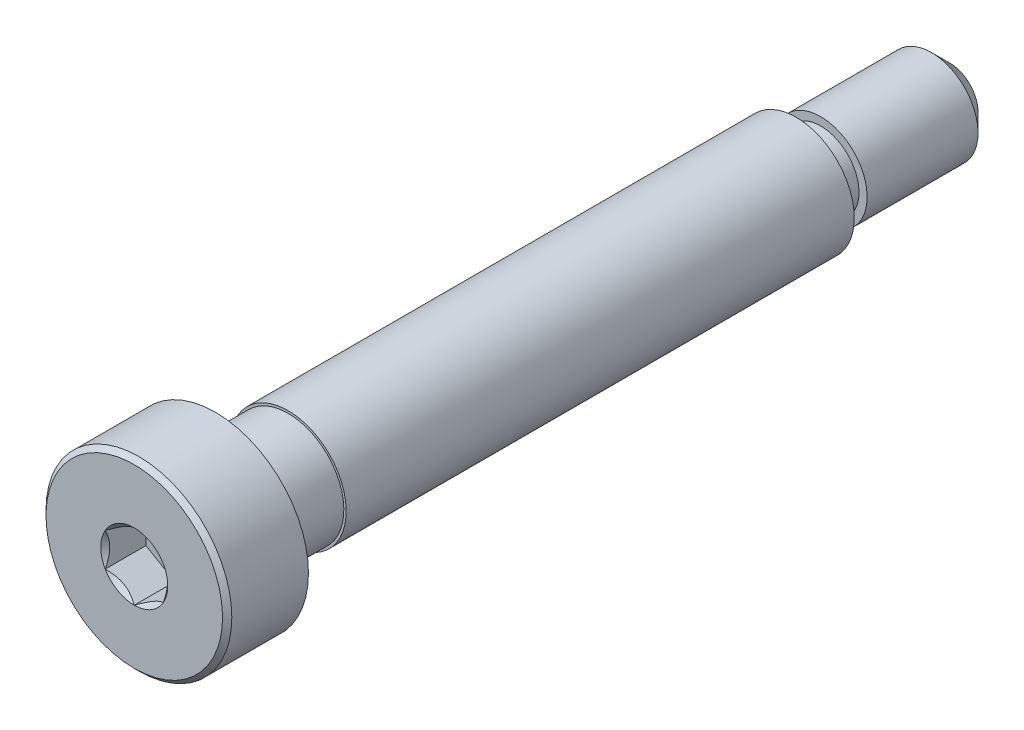
ISO-10303-21;
HEADER;
FILE_DESCRIPTION(('STEP AP214'),'2;1');
FILE_NAME('part.step','',(''),(''),'','','');
FILE_SCHEMA(('AUTOMOTIVE_DESIGN { 1 0 10303 214 1 1 1 1 }'));
ENDSEC;
DATA;
#1=APPLICATION_CONTEXT('core data for automotive mechanical design processes');
#2=APPLICATION_PROTOCOL_DEFINITION('international standard','automotive_design',2000,#1);
#3=PRODUCT_CONTEXT('',#1,'mechanical');
#4=PRODUCT('Part','Part','',(#3));
#5=PRODUCT_RELATED_PRODUCT_CATEGORY('part','',(#4));
#6=PRODUCT_DEFINITION_FORMATION('','',#4);
#7=PRODUCT_DEFINITION_CONTEXT('part definition',#1,'design');
#8=PRODUCT_DEFINITION('design','',#6,#7);
#9=PRODUCT_DEFINITION_SHAPE('','',#8);
#10=(LENGTH_UNIT() NAMED_UNIT(*) SI_UNIT(.MILLI.,.METRE.));
#11=(NAMED_UNIT(*) PLANE_ANGLE_UNIT() SI_UNIT($,.RADIAN.));
#12=(NAMED_UNIT(*) SI_UNIT($,.STERADIAN.) SOLID_ANGLE_UNIT());
#13=UNCERTAINTY_MEASURE_WITH_UNIT(LENGTH_MEASURE(1.E-05),#10,'distance_accuracy_value','');
#14=(GEOMETRIC_REPRESENTATION_CONTEXT(3) GLOBAL_UNCERTAINTY_ASSIGNED_CONTEXT((#13)) GLOBAL_UNIT_ASSIGNED_CONTEXT((#10,
#11,#12)) REPRESENTATION_CONTEXT('',''));
#15=CARTESIAN_POINT('',(0.,0.,0.));
#16=DIRECTION('',(0.,0.,1.));
#17=DIRECTION('',(1.,0.,0.));
#18=AXIS2_PLACEMENT_3D('',#15,#16,#17);
#19=CARTESIAN_POINT('',(0.,0.,35.1165));
#20=DIRECTION('',(0.,0.,1.));
#21=DIRECTION('',(0.,-1.,0.));
#22=AXIS2_PLACEMENT_3D('',#19,#20,#21);
#23=CYLINDRICAL_SURFACE('',#22,8.);
#24=CARTESIAN_POINT('',(0.,0.,28.1165));
#25=DIRECTION('',(0.,0.,1.));
#26=DIRECTION('',(0.,-1.,0.));
#27=AXIS2_PLACEMENT_3D('',#24,#25,#26);
#28=CIRCLE('',#27,8.);
#29=CARTESIAN_POINT('',(0.,-8.,28.1165));
#30=VERTEX_POINT('',#29);
#31=EDGE_CURVE('E170',#30,#30,#28,.T.);
#32=ORIENTED_EDGE('',*,*,#31,.T.);
#33=EDGE_LOOP('',(#32));
#34=FACE_BOUND('',#33,.T.);
#35=CARTESIAN_POINT('',(0.,0.,34.7165));
#36=DIRECTION('',(0.,0.,1.));
#37=DIRECTION('',(0.,-1.,0.));
#38=AXIS2_PLACEMENT_3D('',#35,#36,#37);
#39=CIRCLE('',#38,7.99999999999999);
#40=CARTESIAN_POINT('',(0.,-8.,34.7165));
#41=VERTEX_POINT('',#40);
#42=EDGE_CURVE('E423',#41,#41,#39,.T.);
#43=ORIENTED_EDGE('',*,*,#42,.F.);
#44=EDGE_LOOP('',(#43));
#45=FACE_BOUND('',#44,.T.);
#46=ADVANCED_FACE('F43',(#34,#45),#23,.T.);
#47=CARTESIAN_POINT('',(0.,5.,-21.8835));
#48=DIRECTION('',(0.,0.,1.));
#49=DIRECTION('',(0.,-1.,0.));
#50=AXIS2_PLACEMENT_3D('',#47,#48,#49);
#51=PLANE('',#50);
#52=CARTESIAN_POINT('',(0.,0.,-21.8835));
#53=DIRECTION('',(0.,0.,1.));
#54=DIRECTION('',(0.,-1.,0.));
#55=AXIS2_PLACEMENT_3D('',#52,#53,#54);
#56=CIRCLE('',#55,3.650794);
#57=CARTESIAN_POINT('',(0.,-3.650794,-21.8835));
#58=VERTEX_POINT('',#57);
#59=EDGE_CURVE('E143',#58,#58,#56,.T.);
#60=ORIENTED_EDGE('',*,*,#59,.T.);
#61=EDGE_LOOP('',(#60));
#62=FACE_BOUND('',#61,.T.);
#63=CARTESIAN_POINT('',(0.,0.,-21.8835));
#64=DIRECTION('',(0.,0.,1.));
#65=DIRECTION('',(0.,-1.,0.));
#66=AXIS2_PLACEMENT_3D('',#63,#64,#65);
#67=CIRCLE('',#66,4.);
#68=CARTESIAN_POINT('',(0.,-4.,-21.8835));
#69=VERTEX_POINT('',#68);
#70=EDGE_CURVE('E163',#69,#69,#67,.T.);
#71=ORIENTED_EDGE('',*,*,#70,.F.);
#72=EDGE_LOOP('',(#71));
#73=FACE_BOUND('',#72,.T.);
#74=ADVANCED_FACE('F253',(#62,#73),#51,.F.);
#75=CARTESIAN_POINT('',(0.,4.,-35.1165));
#76=DIRECTION('',(0.,0.,1.));
#77=DIRECTION('',(0.,-1.,0.));
#78=AXIS2_PLACEMENT_3D('',#75,#76,#77);
#79=PLANE('',#78);
#80=CARTESIAN_POINT('',(0.,0.,-35.1165));
#81=DIRECTION('',(0.,0.,1.));
#82=DIRECTION('',(0.,-1.,0.));
#83=AXIS2_PLACEMENT_3D('',#80,#81,#82);
#84=CIRCLE('',#83,2.42106159775);
#85=CARTESIAN_POINT('',(0.,-2.42106159775,-35.1165));
#86=VERTEX_POINT('',#85);
#87=EDGE_CURVE('E12',#86,#86,#84,.F.);
#88=ORIENTED_EDGE('',*,*,#87,.T.);
#89=EDGE_LOOP('',(#88));
#90=FACE_BOUND('',#89,.T.);
#91=ADVANCED_FACE('F261',(#90),#79,.F.);
#92=CARTESIAN_POINT('',(0.,0.,35.1165));
#93=DIRECTION('',(0.,0.,1.));
#94=DIRECTION('',(0.,-1.,0.));
#95=AXIS2_PLACEMENT_3D('',#92,#93,#94);
#96=CYLINDRICAL_SURFACE('',#95,4.);
#97=CARTESIAN_POINT('',(0.,0.,-33.53756159775));
#98=DIRECTION('',(0.,0.,1.));
#99=DIRECTION('',(0.,-1.,0.));
#100=AXIS2_PLACEMENT_3D('',#97,#98,#99);
#101=CIRCLE('',#100,4.);
#102=CARTESIAN_POINT('',(0.,-4.00000000000001,-33.53756159775));
#103=VERTEX_POINT('',#102);
#104=EDGE_CURVE('E51',#103,#103,#101,.T.);
#105=ORIENTED_EDGE('',*,*,#104,.T.);
#106=EDGE_LOOP('',(#105));
#107=FACE_BOUND('',#106,.T.);
#108=CARTESIAN_POINT('',(0.,0.,-23.988751203));
#109=DIRECTION('',(0.,0.,1.));
#110=DIRECTION('',(0.,-1.,0.));
#111=AXIS2_PLACEMENT_3D('',#108,#109,#110);
#112=CIRCLE('',#111,4.);
#113=CARTESIAN_POINT('',(0.,-4.00000000000001,-23.988751203));
#114=VERTEX_POINT('',#113);
#115=EDGE_CURVE('E154',#114,#114,#112,.T.);
#116=ORIENTED_EDGE('',*,*,#115,.F.);
#117=EDGE_LOOP('',(#116));
#118=FACE_BOUND('',#117,.T.);
#119=ADVANCED_FACE('F446',(#107,#118),#96,.T.);
#120=CARTESIAN_POINT('',(0.,3.301588,-23.988751203));
#121=DIRECTION('',(0.,0.,-1.));
#122=DIRECTION('',(0.,1.,0.));
#123=AXIS2_PLACEMENT_3D('',#120,#121,#122);
#124=PLANE('',#123);
#125=CARTESIAN_POINT('',(0.,0.,-23.988751203));
#126=DIRECTION('',(0.,0.,1.));
#127=DIRECTION('',(0.,-1.,0.));
#128=AXIS2_PLACEMENT_3D('',#125,#126,#127);
#129=CIRCLE('',#128,3.301588);
#130=CARTESIAN_POINT('',(0.,-3.301588,-23.988751203));
#131=VERTEX_POINT('',#130);
#132=EDGE_CURVE('E157',#131,#131,#129,.T.);
#133=ORIENTED_EDGE('',*,*,#132,.F.);
#134=EDGE_LOOP('',(#133));
#135=FACE_BOUND('',#134,.T.);
#136=ORIENTED_EDGE('',*,*,#115,.T.);
#137=EDGE_LOOP('',(#136));
#138=FACE_BOUND('',#137,.T.);
#139=ADVANCED_FACE('F300',(#135,#138),#124,.F.);
#140=CARTESIAN_POINT('',(0.,0.,35.1165));
#141=DIRECTION('',(0.,0.,1.));
#142=DIRECTION('',(0.,-1.,0.));
#143=AXIS2_PLACEMENT_3D('',#140,#141,#142);
#144=CYLINDRICAL_SURFACE('',#143,3.301588);
#145=CARTESIAN_POINT('',(0.,0.,-22.232706));
#146=DIRECTION('',(0.,0.,1.));
#147=DIRECTION('',(0.,-1.,0.));
#148=AXIS2_PLACEMENT_3D('',#145,#146,#147);
#149=CIRCLE('',#148,3.301588);
#150=CARTESIAN_POINT('',(0.,-3.301588,-22.232706));
#151=VERTEX_POINT('',#150);
#152=EDGE_CURVE('E160',#151,#151,#149,.T.);
#153=ORIENTED_EDGE('',*,*,#152,.F.);
#154=EDGE_LOOP('',(#153));
#155=FACE_BOUND('',#154,.T.);
#156=ORIENTED_EDGE('',*,*,#132,.T.);
#157=EDGE_LOOP('',(#156));
#158=FACE_BOUND('',#157,.T.);
#159=ADVANCED_FACE('F287',(#155,#158),#144,.T.);
#160=CARTESIAN_POINT('',(0.,0.,-22.232706));
#161=DIRECTION('',(0.,0.,1.));
#162=DIRECTION('',(0.,-1.,0.));
#163=AXIS2_PLACEMENT_3D('',#160,#161,#162);
#164=TOROIDAL_SURFACE('',#163,3.650794,0.349206000000001);
#165=ORIENTED_EDGE('',*,*,#59,.F.);
#166=EDGE_LOOP('',(#165));
#167=FACE_BOUND('',#166,.T.);
#168=ORIENTED_EDGE('',*,*,#152,.T.);
#169=EDGE_LOOP('',(#168));
#170=FACE_BOUND('',#169,.T.);
#171=ADVANCED_FACE('F282',(#167,#170),#164,.F.);
#172=CARTESIAN_POINT('',(0.,0.,-21.8835));
#173=DIRECTION('',(0.,0.,-1.));
#174=DIRECTION('',(0.,1.,0.));
#175=AXIS2_PLACEMENT_3D('',#172,#173,#174);
#176=CONICAL_SURFACE('',#175,4.,1.55258119874307);
#177=CARTESIAN_POINT('',(0.,0.,-21.8828060419975));
#178=DIRECTION('',(0.,0.,1.));
#179=DIRECTION('',(0.,-1.,0.));
#180=AXIS2_PLACEMENT_3D('',#177,#178,#179);
#181=CIRCLE('',#180,3.9619063204417);
#182=CARTESIAN_POINT('',(0.,-3.9619063204417,-21.8828060419975));
#183=VERTEX_POINT('',#182);
#184=EDGE_CURVE('E173',#183,#183,#181,.T.);
#185=ORIENTED_EDGE('',*,*,#184,.F.);
#186=EDGE_LOOP('',(#185));
#187=FACE_BOUND('',#186,.T.);
#188=ORIENTED_EDGE('',*,*,#70,.T.);
#189=EDGE_LOOP('',(#188));
#190=FACE_BOUND('',#189,.T.);
#191=ADVANCED_FACE('F279',(#187,#190),#176,.T.);
#192=CARTESIAN_POINT('',(0.,0.,21.8671939580025));
#193=DIRECTION('',(0.,0.,-1.));
#194=DIRECTION('',(0.,1.,0.));
#195=AXIS2_PLACEMENT_3D('',#192,#193,#194);
#196=CONICAL_SURFACE('',#195,4.7589063204417,1.55258119874298);
#197=CARTESIAN_POINT('',(0.,0.,21.8665));
#198=DIRECTION('',(0.,0.,1.));
#199=DIRECTION('',(0.,-1.,0.));
#200=AXIS2_PLACEMENT_3D('',#197,#198,#199);
#201=CIRCLE('',#200,4.797);
#202=CARTESIAN_POINT('',(0.,-4.797,21.8665));
#203=VERTEX_POINT('',#202);
#204=EDGE_CURVE('E169',#203,#203,#201,.T.);
#205=ORIENTED_EDGE('',*,*,#204,.F.);
#206=EDGE_LOOP('',(#205));
#207=FACE_BOUND('',#206,.T.);
#208=CARTESIAN_POINT('',(0.,0.,21.8671939580025));
#209=DIRECTION('',(0.,0.,1.));
#210=DIRECTION('',(0.,-1.,0.));
#211=AXIS2_PLACEMENT_3D('',#208,#209,#210);
#212=CIRCLE('',#211,4.7589063204417);
#213=CARTESIAN_POINT('',(0.,-4.7589063204417,21.8671939580025));
#214=VERTEX_POINT('',#213);
#215=EDGE_CURVE('E174',#214,#214,#212,.T.);
#216=ORIENTED_EDGE('',*,*,#215,.T.);
#217=EDGE_LOOP('',(#216));
#218=FACE_BOUND('',#217,.T.);
#219=ADVANCED_FACE('F275',(#207,#218),#196,.F.);
#220=CARTESIAN_POINT('',(0.,0.,21.8671939580025));
#221=DIRECTION('',(0.,0.,1.));
#222=DIRECTION('',(0.,-1.,0.));
#223=AXIS2_PLACEMENT_3D('',#220,#221,#222);
#224=CONICAL_SURFACE('',#223,4.7589063204417,0.0182151280518959);
#225=ORIENTED_EDGE('',*,*,#184,.T.);
#226=EDGE_LOOP('',(#225));
#227=FACE_BOUND('',#226,.T.);
#228=ORIENTED_EDGE('',*,*,#215,.F.);
#229=EDGE_LOOP('',(#228));
#230=FACE_BOUND('',#229,.T.);
#231=ADVANCED_FACE('F272',(#227,#230),#224,.T.);
#232=CARTESIAN_POINT('',(0.,7.99999999999999,28.1165));
#233=DIRECTION('',(0.,0.,1.));
#234=DIRECTION('',(0.,-1.,0.));
#235=AXIS2_PLACEMENT_3D('',#232,#233,#234);
#236=PLANE('',#235);
#237=ORIENTED_EDGE('',*,*,#31,.F.);
#238=EDGE_LOOP('',(#237));
#239=FACE_BOUND('',#238,.T.);
#240=CARTESIAN_POINT('',(0.,0.,28.1165));
#241=DIRECTION('',(0.,0.,1.));
#242=DIRECTION('',(0.,-1.,0.));
#243=AXIS2_PLACEMENT_3D('',#240,#241,#242);
#244=CIRCLE('',#243,4.797);
#245=CARTESIAN_POINT('',(0.,-4.797,28.1165));
#246=VERTEX_POINT('',#245);
#247=EDGE_CURVE('E166',#246,#246,#244,.T.);
#248=ORIENTED_EDGE('',*,*,#247,.T.);
#249=EDGE_LOOP('',(#248));
#250=FACE_BOUND('',#249,.T.);
#251=ADVANCED_FACE('F266',(#239,#250),#236,.F.);
#252=CARTESIAN_POINT('',(0.,0.,35.1165));
#253=DIRECTION('',(0.,0.,1.));
#254=DIRECTION('',(0.,-1.,0.));
#255=AXIS2_PLACEMENT_3D('',#252,#253,#254);
#256=CYLINDRICAL_SURFACE('',#255,4.797);
#257=ORIENTED_EDGE('',*,*,#247,.F.);
#258=EDGE_LOOP('',(#257));
#259=FACE_BOUND('',#258,.T.);
#260=ORIENTED_EDGE('',*,*,#204,.T.);
#261=EDGE_LOOP('',(#260));
#262=FACE_BOUND('',#261,.T.);
#263=ADVANCED_FACE('F306',(#259,#262),#256,.T.);
#264=CARTESIAN_POINT('',(0.,0.,-33.53756159775));
#265=DIRECTION('',(0.,0.,1.));
#266=DIRECTION('',(0.,-1.,0.));
#267=AXIS2_PLACEMENT_3D('',#264,#265,#266);
#268=CONICAL_SURFACE('',#267,4.,0.785398163397455);
#269=ORIENTED_EDGE('',*,*,#87,.F.);
#270=EDGE_LOOP('',(#269));
#271=FACE_BOUND('',#270,.T.);
#272=ORIENTED_EDGE('',*,*,#104,.F.);
#273=EDGE_LOOP('',(#272));
#274=FACE_BOUND('',#273,.T.);
#275=ADVANCED_FACE('F45',(#271,#274),#268,.T.);
#276=CARTESIAN_POINT('',(0.,0.,35.1165));
#277=DIRECTION('',(0.,0.,-1.));
#278=DIRECTION('',(0.,1.,0.));
#279=AXIS2_PLACEMENT_3D('',#276,#277,#278);
#280=CONICAL_SURFACE('',#279,7.6,0.785398163397449);
#281=ORIENTED_EDGE('',*,*,#42,.T.);
#282=EDGE_LOOP('',(#281));
#283=FACE_BOUND('',#282,.T.);
#284=CARTESIAN_POINT('',(0.,0.,35.1165));
#285=DIRECTION('',(0.,0.,1.));
#286=DIRECTION('',(0.,-1.,0.));
#287=AXIS2_PLACEMENT_3D('',#284,#285,#286);
#288=CIRCLE('',#287,7.6);
#289=CARTESIAN_POINT('',(0.,-7.6,35.1165));
#290=VERTEX_POINT('',#289);
#291=EDGE_CURVE('E426',#290,#290,#288,.T.);
#292=ORIENTED_EDGE('',*,*,#291,.F.);
#293=EDGE_LOOP('',(#292));
#294=FACE_BOUND('',#293,.T.);
#295=ADVANCED_FACE('F199',(#283,#294),#280,.T.);
#296=CARTESIAN_POINT('',(0.,0.,31.6165));
#297=DIRECTION('',(0.,0.,1.));
#298=DIRECTION('',(1.,0.,0.));
#299=AXIS2_PLACEMENT_3D('',#296,#297,#298);
#300=PLANE('',#299);
#301=DIRECTION('',(-0.866025403784439,0.499999999999999,0.));
#302=VECTOR('',#301,1.);
#303=CARTESIAN_POINT('',(2.5,1.44337567297407,31.6165));
#304=LINE('',#303,#302);
#305=CARTESIAN_POINT('',(2.5,1.44337567297407,31.6165));
#306=VERTEX_POINT('',#305);
#307=CARTESIAN_POINT('',(0.,2.88675134594813,31.6165));
#308=VERTEX_POINT('',#307);
#309=EDGE_CURVE('E102',#306,#308,#304,.T.);
#310=ORIENTED_EDGE('',*,*,#309,.T.);
#311=DIRECTION('',(-0.866025403784438,-0.5,0.));
#312=VECTOR('',#311,1.);
#313=CARTESIAN_POINT('',(0.,2.88675134594813,31.6165));
#314=LINE('',#313,#312);
#315=CARTESIAN_POINT('',(-2.5,1.44337567297406,31.6165));
#316=VERTEX_POINT('',#315);
#317=EDGE_CURVE('E112',#308,#316,#314,.T.);
#318=ORIENTED_EDGE('',*,*,#317,.T.);
#319=DIRECTION('',(0.,-1.,0.));
#320=VECTOR('',#319,1.);
#321=CARTESIAN_POINT('',(-2.5,1.44337567297406,31.6165));
#322=LINE('',#321,#320);
#323=CARTESIAN_POINT('',(-2.5,-1.44337567297407,31.6165));
#324=VERTEX_POINT('',#323);
#325=EDGE_CURVE('E118',#316,#324,#322,.T.);
#326=ORIENTED_EDGE('',*,*,#325,.T.);
#327=DIRECTION('',(0.866025403784439,-0.5,0.));
#328=VECTOR('',#327,1.);
#329=CARTESIAN_POINT('',(-2.5,-1.44337567297407,31.6165));
#330=LINE('',#329,#328);
#331=CARTESIAN_POINT('',(0.,-2.88675134594813,31.6165));
#332=VERTEX_POINT('',#331);
#333=EDGE_CURVE('E135',#324,#332,#330,.T.);
#334=ORIENTED_EDGE('',*,*,#333,.T.);
#335=DIRECTION('',(0.866025403784438,0.5,0.));
#336=VECTOR('',#335,1.);
#337=CARTESIAN_POINT('',(0.,-2.88675134594813,31.6165));
#338=LINE('',#337,#336);
#339=CARTESIAN_POINT('',(2.5,-1.44337567297406,31.6165));
#340=VERTEX_POINT('',#339);
#341=EDGE_CURVE('E138',#332,#340,#338,.T.);
#342=ORIENTED_EDGE('',*,*,#341,.T.);
#343=DIRECTION('',(0.,1.,0.));
#344=VECTOR('',#343,1.);
#345=CARTESIAN_POINT('',(2.5,-1.44337567297406,31.6165));
#346=LINE('',#345,#344);
#347=EDGE_CURVE('E109',#340,#306,#346,.T.);
#348=ORIENTED_EDGE('',*,*,#347,.T.);
#349=EDGE_LOOP('',(#310,#318,#326,#334,#342,#348));
#350=FACE_BOUND('',#349,.T.);
#351=ADVANCED_FACE('F120',(#350),#300,.T.);
#352=CARTESIAN_POINT('',(-2.5,1.44337567297406,31.6165));
#353=DIRECTION('',(-1.,0.,0.));
#354=DIRECTION('',(0.,0.,1.));
#355=AXIS2_PLACEMENT_3D('',#352,#353,#354);
#356=PLANE('',#355);
#357=DIRECTION('',(0.,0.,1.));
#358=VECTOR('',#357,1.);
#359=CARTESIAN_POINT('',(-2.5,1.44337567297406,31.6165));
#360=LINE('',#359,#358);
#361=CARTESIAN_POINT('',(-2.5,1.44337567297407,35.1165));
#362=VERTEX_POINT('',#361);
#363=EDGE_CURVE('E108',#316,#362,#360,.T.);
#364=ORIENTED_EDGE('',*,*,#363,.T.);
#365=CARTESIAN_POINT('',(-2.5,-2.87868021616155,36.0424641937847));
#366=CARTESIAN_POINT('',(-2.5,-2.80858751756355,35.9895547693995));
#367=CARTESIAN_POINT('',(-2.5,-2.73810237384458,35.9371567848064));
#368=CARTESIAN_POINT('',(-2.5,-2.5961923890747,35.8336126835152));
#369=CARTESIAN_POINT('',(-2.5,-2.52476731657143,35.7824668843779));
#370=CARTESIAN_POINT('',(-2.5,-2.38030019419699,35.6812924979814));
#371=CARTESIAN_POINT('',(-2.5,-2.307249903594,35.6312756377845));
#372=CARTESIAN_POINT('',(-2.5,-2.15990937397294,35.5331088439155));
#373=CARTESIAN_POINT('',(-2.5,-2.08561922308944,35.4849587783455));
#374=CARTESIAN_POINT('',(-2.5,-1.93130274871409,35.388246559452));
#375=CARTESIAN_POINT('',(-2.5,-1.85119168497851,35.3398189325373));
#376=CARTESIAN_POINT('',(-2.5,-1.68912282627168,35.2461640597041));
#377=CARTESIAN_POINT('',(-2.5,-1.60716527674864,35.2009363916948));
#378=CARTESIAN_POINT('',(-2.5,-1.44137668632319,35.1146353746693));
#379=CARTESIAN_POINT('',(-2.5,-1.35755175925796,35.0735503726636));
#380=CARTESIAN_POINT('',(-2.5,-1.18761577759421,34.9964618661066));
#381=CARTESIAN_POINT('',(-2.5,-1.1015057792473,34.9604560607346));
#382=CARTESIAN_POINT('',(-2.5,-0.933895283730376,34.8974497442851));
#383=CARTESIAN_POINT('',(-2.5,-0.852581486652414,34.8699577201431));
#384=CARTESIAN_POINT('',(-2.5,-0.687996185051427,34.8214971144174));
#385=CARTESIAN_POINT('',(-2.5,-0.604724546085164,34.800528982239));
#386=CARTESIAN_POINT('',(-2.5,-0.438105786501651,34.766559995013));
#387=CARTESIAN_POINT('',(-2.5,-0.354786957377883,34.7534226334436));
#388=CARTESIAN_POINT('',(-2.5,-0.187258638268774,34.7353701943996));
#389=CARTESIAN_POINT('',(-2.5,-0.103049303891734,34.7304537035302));
#390=CARTESIAN_POINT('',(-2.5,0.0623819458555483,34.7292080743719));
#391=CARTESIAN_POINT('',(-2.5,0.143601667742493,34.7325745517109));
#392=CARTESIAN_POINT('',(-2.5,0.305344840533964,34.7470375923809));
#393=CARTESIAN_POINT('',(-2.5,0.385868223029657,34.7581349066531));
#394=CARTESIAN_POINT('',(-2.5,0.54699999247773,34.7876420785853));
#395=CARTESIAN_POINT('',(-2.5,0.627585258156379,34.8061763768309));
#396=CARTESIAN_POINT('',(-2.5,0.786991930978587,34.8495723320141));
#397=CARTESIAN_POINT('',(-2.5,0.865813485110825,34.8744334595174));
#398=CARTESIAN_POINT('',(-2.5,1.11399280220491,34.9620589112399));
#399=CARTESIAN_POINT('',(-2.5,1.27984027529456,35.0348033354746));
#400=CARTESIAN_POINT('',(-2.5,1.52253018655038,35.1560423452678));
#401=CARTESIAN_POINT('',(-2.5,1.60256472908879,35.1985714512072));
#402=CARTESIAN_POINT('',(-2.5,1.76081489282124,35.2868965241522));
#403=CARTESIAN_POINT('',(-2.5,1.83903083842886,35.3326919024767));
#404=CARTESIAN_POINT('',(-2.5,1.99000684607167,35.4245446787286));
#405=CARTESIAN_POINT('',(-2.5,2.06284472030444,35.4704756354244));
#406=CARTESIAN_POINT('',(-2.5,2.20727164736135,35.5642702453865));
#407=CARTESIAN_POINT('',(-2.5,2.27886060500402,35.6121340450436));
#408=CARTESIAN_POINT('',(-2.5,2.42037078548403,35.7090522363183));
#409=CARTESIAN_POINT('',(-2.5,2.49030083172878,35.7580937983162));
#410=CARTESIAN_POINT('',(-2.5,2.62920524991558,35.8574738351898));
#411=CARTESIAN_POINT('',(-2.5,2.69817987937839,35.9078119497074));
#412=CARTESIAN_POINT('',(-2.5,2.76675463365823,35.9586802976824));
#413=B_SPLINE_CURVE_WITH_KNOTS('',3,(#365,#366,#367,#368,#369,#370,#371,#372,#373,#374,#375,
#376,#377,#378,#379,#380,#381,#382,#383,#384,#385,#386,#387,#388,#389,#390,#391,#392,#393,#394,
#395,#396,#397,#398,#399,#400,#401,#402,#403,#404,#405,#406,#407,#408,#409,#410,#411,#412),
.UNSPECIFIED.,.F.,.F.,(4,2,2,2,2,2,2,2,2,2,2,2,2,2,2,2,2,2,2,2,2,2,2,4),(0.,0.263465914971116,
0.526997968323237,0.79257194327936,1.05812711983772,1.33890112548019,1.61963802629079,
1.89956181222216,2.17935838571898,2.436638876826,2.69393708705248,2.94660788173135,
3.19923523085016,3.44271854486786,3.6862255131336,3.93398926860573,4.18173229781969,
4.72334004841908,4.99521600382014,5.26704308216966,5.52534341671993,5.78366335141086,
6.03988492204047,6.29603603207541),.UNSPECIFIED.);
#414=CARTESIAN_POINT('',(-2.5,-1.44337567297407,35.1165));
#415=VERTEX_POINT('',#414);
#416=EDGE_CURVE('E206',#362,#415,#413,.F.);
#417=ORIENTED_EDGE('',*,*,#416,.T.);
#418=DIRECTION('',(0.,0.,1.));
#419=VECTOR('',#418,1.);
#420=CARTESIAN_POINT('',(-2.5,-1.44337567297407,31.6165));
#421=LINE('',#420,#419);
#422=EDGE_CURVE('E150',#324,#415,#421,.T.);
#423=ORIENTED_EDGE('',*,*,#422,.F.);
#424=ORIENTED_EDGE('',*,*,#325,.F.);
#425=EDGE_LOOP('',(#364,#417,#423,#424));
#426=FACE_BOUND('',#425,.T.);
#427=ADVANCED_FACE('F243',(#426),#356,.F.);
#428=CARTESIAN_POINT('',(-2.5,-1.44337567297407,31.6165));
#429=DIRECTION('',(-0.499999999999999,-0.866025403784439,0.));
#430=DIRECTION('',(0.866025403784439,-0.5,0.));
#431=AXIS2_PLACEMENT_3D('',#428,#429,#430);
#432=PLANE('',#431);
#433=ORIENTED_EDGE('',*,*,#422,.T.);
#434=CARTESIAN_POINT('',(-2.5002,-1.44326020292023,35.1166154769818));
#435=CARTESIAN_POINT('',(-2.41426172221223,-1.49287669073469,35.0670407053547));
#436=CARTESIAN_POINT('',(-2.32688643272424,-1.5433228376411,35.0203774813625));
#437=CARTESIAN_POINT('',(-2.14871854383441,-1.64618811625259,34.9349381400383));
#438=CARTESIAN_POINT('',(-2.05790899931892,-1.6986170312236,34.896209562406));
#439=CARTESIAN_POINT('',(-1.87479587687308,-1.80433744175986,34.8298667038977));
#440=CARTESIAN_POINT('',(-1.78253893547066,-1.85760201171316,34.8020856685309));
#441=CARTESIAN_POINT('',(-1.59599399122371,-1.96530378549009,34.7592831759107));
#442=CARTESIAN_POINT('',(-1.50171168743371,-2.01973769896307,34.7442297666713));
#443=CARTESIAN_POINT('',(-1.33922174170815,-2.11355131286833,34.7306477222095));
#444=CARTESIAN_POINT('',(-1.27122403211985,-2.15280980880341,34.7286370992408));
#445=CARTESIAN_POINT('',(-1.13533975883078,-2.23126263056549,34.7320241171875));
#446=CARTESIAN_POINT('',(-1.06745324244776,-2.27045692907358,34.7374243552998));
#447=CARTESIAN_POINT('',(-0.932321211763892,-2.34847544336505,34.7553257884025));
#448=CARTESIAN_POINT('',(-0.865076500246438,-2.38729919566123,34.7678349270465));
#449=CARTESIAN_POINT('',(-0.731749899181799,-2.46427534467604,34.7992675019557));
#450=CARTESIAN_POINT('',(-0.665667920900341,-2.50242779262542,34.8181904464968));
#451=CARTESIAN_POINT('',(-0.496403653308733,-2.60015256308362,34.8743673614082));
#452=CARTESIAN_POINT('',(-0.394270877777105,-2.65911894852989,34.9158558315962));
#453=CARTESIAN_POINT('',(-0.244093585059489,-2.74582384890657,34.9858940467231));
#454=CARTESIAN_POINT('',(-0.194603460117389,-2.77439698586412,35.0105022521161));
#455=CARTESIAN_POINT('',(-0.0965399361611518,-2.83101398781794,35.0619618867152));
#456=CARTESIAN_POINT('',(-0.0479659965030709,-2.85905816495513,35.0888119387794));
#457=CARTESIAN_POINT('',(0.00020000000000146,-2.88686681600197,35.1166154769818));
#458=B_SPLINE_CURVE_WITH_KNOTS('',3,(#434,#435,#436,#437,#438,#439,#440,#441,#442,#443,#444,
#445,#446,#447,#448,#449,#450,#451,#452,#453,#454,#455,#456,#457),.UNSPECIFIED.,.F.,.F.,(4,2,2,
2,2,2,2,2,2,2,2,4),(0.,0.333012085133927,0.6679645183014,0.9975970320433,1.32639954393844,
1.56169424147169,1.79707142102083,2.03271213522171,2.26833478775651,2.64260240809533,
2.82922877818864,3.01574133749025),.UNSPECIFIED.);
#459=CARTESIAN_POINT('',(0.,-2.88675134594813,35.1165));
#460=VERTEX_POINT('',#459);
#461=EDGE_CURVE('E214',#415,#460,#458,.T.);
#462=ORIENTED_EDGE('',*,*,#461,.T.);
#463=DIRECTION('',(0.,0.,1.));
#464=VECTOR('',#463,1.);
#465=CARTESIAN_POINT('',(0.,-2.88675134594813,31.6165));
#466=LINE('',#465,#464);
#467=EDGE_CURVE('E147',#332,#460,#466,.T.);
#468=ORIENTED_EDGE('',*,*,#467,.F.);
#469=ORIENTED_EDGE('',*,*,#333,.F.);
#470=EDGE_LOOP('',(#433,#462,#468,#469));
#471=FACE_BOUND('',#470,.T.);
#472=ADVANCED_FACE('F239',(#471),#432,.F.);
#473=CARTESIAN_POINT('',(0.,-2.88675134594813,31.6165));
#474=DIRECTION('',(0.5,-0.866025403784438,0.));
#475=DIRECTION('',(0.866025403784438,0.5,0.));
#476=AXIS2_PLACEMENT_3D('',#473,#474,#475);
#477=PLANE('',#476);
#478=ORIENTED_EDGE('',*,*,#467,.T.);
#479=CARTESIAN_POINT('',(-0.000199999999996979,-2.88686681600197,35.1166154769818));
#480=CARTESIAN_POINT('',(0.0857382777877688,-2.83725032818751,35.0670407053547));
#481=CARTESIAN_POINT('',(0.173113567275757,-2.7868041812811,35.0203774813625));
#482=CARTESIAN_POINT('',(0.351281456165593,-2.6839389026696,34.9349381400383));
#483=CARTESIAN_POINT('',(0.442091000681079,-2.6315099876986,34.896209562406));
#484=CARTESIAN_POINT('',(0.625204123126925,-2.52578957716234,34.8298667038977));
#485=CARTESIAN_POINT('',(0.717461064529345,-2.47252500720904,34.8020856685309));
#486=CARTESIAN_POINT('',(0.90400600877629,-2.3648232334321,34.7592831759107));
#487=CARTESIAN_POINT('',(0.998288312566287,-2.31038931995913,34.7442297666713));
#488=CARTESIAN_POINT('',(1.16077825829185,-2.21657570605387,34.7306477222095));
#489=CARTESIAN_POINT('',(1.22877596788015,-2.17731721011878,34.7286370992408));
#490=CARTESIAN_POINT('',(1.36466024116922,-2.0988643883567,34.7320241171875));
#491=CARTESIAN_POINT('',(1.43254675755224,-2.05967008984862,34.7374243552998));
#492=CARTESIAN_POINT('',(1.56767878823611,-1.98165157555715,34.7553257884025));
#493=CARTESIAN_POINT('',(1.63492349975356,-1.94282782326096,34.7678349270465));
#494=CARTESIAN_POINT('',(1.7682501008182,-1.86585167424616,34.7992675019557));
#495=CARTESIAN_POINT('',(1.83433207909966,-1.82769922629678,34.8181904464968));
#496=CARTESIAN_POINT('',(2.00359634669127,-1.72997445583858,34.8743673614082));
#497=CARTESIAN_POINT('',(2.1057291222229,-1.67100807039231,34.9158558315962));
#498=CARTESIAN_POINT('',(2.25590641494051,-1.58430317001562,34.9858940467231));
#499=CARTESIAN_POINT('',(2.30539653988261,-1.55573003305807,35.0105022521161));
#500=CARTESIAN_POINT('',(2.40346006383885,-1.49911303110426,35.0619618867152));
#501=CARTESIAN_POINT('',(2.45203400349693,-1.47106885396706,35.0888119387794));
#502=CARTESIAN_POINT('',(2.5002,-1.44326020292023,35.1166154769818));
#503=B_SPLINE_CURVE_WITH_KNOTS('',3,(#479,#480,#481,#482,#483,#484,#485,#486,#487,#488,#489,
#490,#491,#492,#493,#494,#495,#496,#497,#498,#499,#500,#501,#502),.UNSPECIFIED.,.F.,.F.,(4,2,2,
2,2,2,2,2,2,2,2,4),(0.,0.333012085133924,0.6679645183014,0.9975970320433,1.32639954393844,
1.56169424147169,1.79707142102083,2.03271213522171,2.26833478775651,2.64260240809533,
2.82922877818863,3.01574133749024),.UNSPECIFIED.);
#504=CARTESIAN_POINT('',(2.5,-1.44337567297406,35.1165));
#505=VERTEX_POINT('',#504);
#506=EDGE_CURVE('E221',#460,#505,#503,.T.);
#507=ORIENTED_EDGE('',*,*,#506,.T.);
#508=DIRECTION('',(0.,0.,1.));
#509=VECTOR('',#508,1.);
#510=CARTESIAN_POINT('',(2.5,-1.44337567297406,31.6165));
#511=LINE('',#510,#509);
#512=EDGE_CURVE('E144',#340,#505,#511,.T.);
#513=ORIENTED_EDGE('',*,*,#512,.F.);
#514=ORIENTED_EDGE('',*,*,#341,.F.);
#515=EDGE_LOOP('',(#478,#507,#513,#514));
#516=FACE_BOUND('',#515,.T.);
#517=ADVANCED_FACE('F235',(#516),#477,.F.);
#518=CARTESIAN_POINT('',(2.5,-1.44337567297406,31.6165));
#519=DIRECTION('',(1.,0.,0.));
#520=DIRECTION('',(0.,0.,-1.));
#521=AXIS2_PLACEMENT_3D('',#518,#519,#520);
#522=PLANE('',#521);
#523=ORIENTED_EDGE('',*,*,#512,.T.);
#524=CARTESIAN_POINT('',(2.5,-2.87868021616155,36.0424641937847));
#525=CARTESIAN_POINT('',(2.5,-2.80858751756355,35.9895547693995));
#526=CARTESIAN_POINT('',(2.5,-2.73810237384458,35.9371567848064));
#527=CARTESIAN_POINT('',(2.5,-2.59619238907469,35.8336126835152));
#528=CARTESIAN_POINT('',(2.5,-2.52476731657143,35.7824668843779));
#529=CARTESIAN_POINT('',(2.5,-2.38030019419698,35.6812924979814));
#530=CARTESIAN_POINT('',(2.5,-2.307249903594,35.6312756377845));
#531=CARTESIAN_POINT('',(2.5,-2.15990937397294,35.5331088439155));
#532=CARTESIAN_POINT('',(2.5,-2.08561922308943,35.4849587783455));
#533=CARTESIAN_POINT('',(2.5,-1.93130274871408,35.388246559452));
#534=CARTESIAN_POINT('',(2.5,-1.8511916849785,35.3398189325373));
#535=CARTESIAN_POINT('',(2.5,-1.68912282627167,35.2461640597041));
#536=CARTESIAN_POINT('',(2.5,-1.60716527674864,35.2009363916948));
#537=CARTESIAN_POINT('',(2.5,-1.44137668632319,35.1146353746693));
#538=CARTESIAN_POINT('',(2.5,-1.35755175925796,35.0735503726636));
#539=CARTESIAN_POINT('',(2.5,-1.1876157775942,34.9964618661066));
#540=CARTESIAN_POINT('',(2.5,-1.10150577924729,34.9604560607346));
#541=CARTESIAN_POINT('',(2.5,-0.933895283730375,34.8974497442851));
#542=CARTESIAN_POINT('',(2.5,-0.852581486652413,34.8699577201431));
#543=CARTESIAN_POINT('',(2.5,-0.687996185051426,34.8214971144174));
#544=CARTESIAN_POINT('',(2.5,-0.604724546085162,34.800528982239));
#545=CARTESIAN_POINT('',(2.5,-0.438105786501648,34.766559995013));
#546=CARTESIAN_POINT('',(2.5,-0.354786957377881,34.7534226334436));
#547=CARTESIAN_POINT('',(2.5,-0.187258638268772,34.7353701943996));
#548=CARTESIAN_POINT('',(2.5,-0.103049303891733,34.7304537035302));
#549=CARTESIAN_POINT('',(2.5,0.0623819458555495,34.7292080743719));
#550=CARTESIAN_POINT('',(2.5,0.143601667742495,34.7325745517109));
#551=CARTESIAN_POINT('',(2.5,0.305344840533965,34.7470375923809));
#552=CARTESIAN_POINT('',(2.5,0.385868223029658,34.7581349066531));
#553=CARTESIAN_POINT('',(2.5,0.546999992477731,34.7876420785853));
#554=CARTESIAN_POINT('',(2.5,0.62758525815638,34.8061763768309));
#555=CARTESIAN_POINT('',(2.5,0.786991930978588,34.8495723320141));
#556=CARTESIAN_POINT('',(2.5,0.865813485110825,34.8744334595174));
#557=CARTESIAN_POINT('',(2.5,1.11399280220491,34.9620589112399));
#558=CARTESIAN_POINT('',(2.5,1.27984027529456,35.0348033354746));
#559=CARTESIAN_POINT('',(2.5,1.52253018655038,35.1560423452678));
#560=CARTESIAN_POINT('',(2.5,1.60256472908879,35.1985714512072));
#561=CARTESIAN_POINT('',(2.5,1.76081489282124,35.2868965241522));
#562=CARTESIAN_POINT('',(2.5,1.83903083842886,35.3326919024767));
#563=CARTESIAN_POINT('',(2.5,1.99000684607167,35.4245446787286));
#564=CARTESIAN_POINT('',(2.5,2.06284472030444,35.4704756354244));
#565=CARTESIAN_POINT('',(2.5,2.20727164736135,35.5642702453865));
#566=CARTESIAN_POINT('',(2.5,2.27886060500402,35.6121340450436));
#567=CARTESIAN_POINT('',(2.5,2.42037078548403,35.7090522363183));
#568=CARTESIAN_POINT('',(2.5,2.49030083172878,35.7580937983162));
#569=CARTESIAN_POINT('',(2.5,2.62920524991558,35.8574738351898));
#570=CARTESIAN_POINT('',(2.5,2.69817987937839,35.9078119497074));
#571=CARTESIAN_POINT('',(2.5,2.76675463365823,35.9586802976824));
#572=B_SPLINE_CURVE_WITH_KNOTS('',3,(#524,#525,#526,#527,#528,#529,#530,#531,#532,#533,#534,
#535,#536,#537,#538,#539,#540,#541,#542,#543,#544,#545,#546,#547,#548,#549,#550,#551,#552,#553,
#554,#555,#556,#557,#558,#559,#560,#561,#562,#563,#564,#565,#566,#567,#568,#569,#570,#571),
.UNSPECIFIED.,.F.,.F.,(4,2,2,2,2,2,2,2,2,2,2,2,2,2,2,2,2,2,2,2,2,2,2,4),(0.,0.263465914971114,
0.526997968323236,0.792571943279366,1.05812711983772,1.33890112548019,1.61963802629079,
1.89956181222216,2.17935838571898,2.436638876826,2.69393708705248,2.94660788173135,
3.19923523085016,3.44271854486786,3.6862255131336,3.93398926860573,4.18173229781968,
4.72334004841908,4.99521600382014,5.26704308216966,5.52534341671993,5.78366335141086,
6.03988492204047,6.29603603207541),.UNSPECIFIED.);
#573=CARTESIAN_POINT('',(2.5,1.44337567297406,35.1165));
#574=VERTEX_POINT('',#573);
#575=EDGE_CURVE('E124',#505,#574,#572,.T.);
#576=ORIENTED_EDGE('',*,*,#575,.T.);
#577=DIRECTION('',(0.,0.,1.));
#578=VECTOR('',#577,1.);
#579=CARTESIAN_POINT('',(2.5,1.44337567297407,31.6165));
#580=LINE('',#579,#578);
#581=EDGE_CURVE('E141',#306,#574,#580,.T.);
#582=ORIENTED_EDGE('',*,*,#581,.F.);
#583=ORIENTED_EDGE('',*,*,#347,.F.);
#584=EDGE_LOOP('',(#523,#576,#582,#583));
#585=FACE_BOUND('',#584,.T.);
#586=ADVANCED_FACE('F232',(#585),#522,.F.);
#587=CARTESIAN_POINT('',(2.5,1.44337567297407,31.6165));
#588=DIRECTION('',(0.499999999999999,0.866025403784439,0.));
#589=DIRECTION('',(-0.866025403784439,0.499999999999999,0.));
#590=AXIS2_PLACEMENT_3D('',#587,#588,#589);
#591=PLANE('',#590);
#592=ORIENTED_EDGE('',*,*,#581,.T.);
#593=CARTESIAN_POINT('',(2.5002,1.44326020292023,35.1166154769818));
#594=CARTESIAN_POINT('',(2.41426172221224,1.49287669073469,35.0670407053547));
#595=CARTESIAN_POINT('',(2.32688643272425,1.5433228376411,35.0203774813625));
#596=CARTESIAN_POINT('',(2.14871854383441,1.64618811625259,34.9349381400383));
#597=CARTESIAN_POINT('',(2.05790899931893,1.6986170312236,34.896209562406));
#598=CARTESIAN_POINT('',(1.87479587687308,1.80433744175986,34.8298667038977));
#599=CARTESIAN_POINT('',(1.78253893547066,1.85760201171315,34.8020856685309));
#600=CARTESIAN_POINT('',(1.59599399122372,1.96530378549009,34.7592831759107));
#601=CARTESIAN_POINT('',(1.50171168743372,2.01973769896307,34.7442297666713));
#602=CARTESIAN_POINT('',(1.33922174170816,2.11355131286833,34.7306477222095));
#603=CARTESIAN_POINT('',(1.27122403211985,2.15280980880341,34.7286370992408));
#604=CARTESIAN_POINT('',(1.13533975883078,2.23126263056549,34.7320241171875));
#605=CARTESIAN_POINT('',(1.06745324244776,2.27045692907357,34.7374243552998));
#606=CARTESIAN_POINT('',(0.932321211763896,2.34847544336505,34.7553257884025));
#607=CARTESIAN_POINT('',(0.865076500246441,2.38729919566123,34.7678349270465));
#608=CARTESIAN_POINT('',(0.731749899181803,2.46427534467603,34.7992675019557));
#609=CARTESIAN_POINT('',(0.665667920900344,2.50242779262542,34.8181904464968));
#610=CARTESIAN_POINT('',(0.496403653308738,2.60015256308361,34.8743673614082));
#611=CARTESIAN_POINT('',(0.39427087777711,2.65911894852988,34.9158558315962));
#612=CARTESIAN_POINT('',(0.244093585059494,2.74582384890657,34.9858940467231));
#613=CARTESIAN_POINT('',(0.194603460117393,2.77439698586412,35.0105022521161));
#614=CARTESIAN_POINT('',(0.0965399361611546,2.83101398781794,35.0619618867152));
#615=CARTESIAN_POINT('',(0.047965996503073,2.85905816495513,35.0888119387794));
#616=CARTESIAN_POINT('',(-0.000200000000000065,2.88686681600197,35.1166154769818));
#617=B_SPLINE_CURVE_WITH_KNOTS('',3,(#593,#594,#595,#596,#597,#598,#599,#600,#601,#602,#603,
#604,#605,#606,#607,#608,#609,#610,#611,#612,#613,#614,#615,#616),.UNSPECIFIED.,.F.,.F.,(4,2,2,
2,2,2,2,2,2,2,2,4),(0.,0.333012085133929,0.667964518301399,0.9975970320433,1.32639954393844,
1.56169424147169,1.79707142102083,2.03271213522171,2.26833478775651,2.64260240809533,
2.82922877818864,3.01574133749025),.UNSPECIFIED.);
#618=CARTESIAN_POINT('',(0.,2.88675134594813,35.1165));
#619=VERTEX_POINT('',#618);
#620=EDGE_CURVE('E104',#574,#619,#617,.T.);
#621=ORIENTED_EDGE('',*,*,#620,.T.);
#622=DIRECTION('',(0.,0.,1.));
#623=VECTOR('',#622,1.);
#624=CARTESIAN_POINT('',(0.,2.88675134594813,31.6165));
#625=LINE('',#624,#623);
#626=EDGE_CURVE('E97',#308,#619,#625,.T.);
#627=ORIENTED_EDGE('',*,*,#626,.F.);
#628=ORIENTED_EDGE('',*,*,#309,.F.);
#629=EDGE_LOOP('',(#592,#621,#627,#628));
#630=FACE_BOUND('',#629,.T.);
#631=ADVANCED_FACE('F100',(#630),#591,.F.);
#632=CARTESIAN_POINT('',(0.,2.88675134594813,31.6165));
#633=DIRECTION('',(-0.5,0.866025403784438,0.));
#634=DIRECTION('',(-0.866025403784439,-0.5,0.));
#635=AXIS2_PLACEMENT_3D('',#632,#633,#634);
#636=PLANE('',#635);
#637=ORIENTED_EDGE('',*,*,#626,.T.);
#638=CARTESIAN_POINT('',(0.000199999999997535,2.88686681600197,35.1166154769818));
#639=CARTESIAN_POINT('',(-0.0857382777877665,2.83725032818751,35.0670407053547));
#640=CARTESIAN_POINT('',(-0.173113567275755,2.7868041812811,35.0203774813625));
#641=CARTESIAN_POINT('',(-0.351281456165591,2.6839389026696,34.9349381400383));
#642=CARTESIAN_POINT('',(-0.442091000681078,2.6315099876986,34.896209562406));
#643=CARTESIAN_POINT('',(-0.625204123126924,2.52578957716234,34.8298667038977));
#644=CARTESIAN_POINT('',(-0.717461064529342,2.47252500720904,34.8020856685309));
#645=CARTESIAN_POINT('',(-0.904006008776288,2.3648232334321,34.7592831759107));
#646=CARTESIAN_POINT('',(-0.998288312566286,2.31038931995913,34.7442297666713));
#647=CARTESIAN_POINT('',(-1.16077825829185,2.21657570605387,34.7306477222095));
#648=CARTESIAN_POINT('',(-1.22877596788015,2.17731721011878,34.7286370992408));
#649=CARTESIAN_POINT('',(-1.36466024116922,2.0988643883567,34.7320241171875));
#650=CARTESIAN_POINT('',(-1.43254675755224,2.05967008984862,34.7374243552998));
#651=CARTESIAN_POINT('',(-1.56767878823611,1.98165157555714,34.7553257884025));
#652=CARTESIAN_POINT('',(-1.63492349975356,1.94282782326096,34.7678349270465));
#653=CARTESIAN_POINT('',(-1.7682501008182,1.86585167424616,34.7992675019557));
#654=CARTESIAN_POINT('',(-1.83433207909966,1.82769922629677,34.8181904464968));
#655=CARTESIAN_POINT('',(-2.00359634669127,1.72997445583857,34.8743673614082));
#656=CARTESIAN_POINT('',(-2.10572912222289,1.67100807039231,34.9158558315962));
#657=CARTESIAN_POINT('',(-2.25590641494051,1.58430317001562,34.9858940467231));
#658=CARTESIAN_POINT('',(-2.30539653988261,1.55573003305807,35.0105022521161));
#659=CARTESIAN_POINT('',(-2.40346006383885,1.49911303110426,35.0619618867152));
#660=CARTESIAN_POINT('',(-2.45203400349693,1.47106885396706,35.0888119387794));
#661=CARTESIAN_POINT('',(-2.5002,1.44326020292023,35.1166154769818));
#662=B_SPLINE_CURVE_WITH_KNOTS('',3,(#638,#639,#640,#641,#642,#643,#644,#645,#646,#647,#648,
#649,#650,#651,#652,#653,#654,#655,#656,#657,#658,#659,#660,#661),.UNSPECIFIED.,.F.,.F.,(4,2,2,
2,2,2,2,2,2,2,2,4),(0.,0.333012085133923,0.667964518301396,0.997597032043297,1.32639954393844,
1.56169424147169,1.79707142102083,2.03271213522171,2.26833478775651,2.64260240809533,
2.82922877818863,3.01574133749024),.UNSPECIFIED.);
#663=EDGE_CURVE('E183',#619,#362,#662,.T.);
#664=ORIENTED_EDGE('',*,*,#663,.T.);
#665=ORIENTED_EDGE('',*,*,#363,.F.);
#666=ORIENTED_EDGE('',*,*,#317,.F.);
#667=EDGE_LOOP('',(#637,#664,#665,#666));
#668=FACE_BOUND('',#667,.T.);
#669=ADVANCED_FACE('F113',(#668),#636,.F.);
#670=CARTESIAN_POINT('',(0.,0.,35.1165));
#671=DIRECTION('',(0.,0.,1.));
#672=DIRECTION('',(1.,0.,0.));
#673=AXIS2_PLACEMENT_3D('',#670,#671,#672);
#674=CONICAL_SURFACE('',#673,2.88675134594813,0.78539816339745);
#675=CARTESIAN_POINT('',(0.,0.,35.1165));
#676=DIRECTION('',(0.,0.,1.));
#677=DIRECTION('',(1.,0.,0.));
#678=AXIS2_PLACEMENT_3D('',#675,#676,#677);
#679=CIRCLE('',#678,2.88675134594813);
#680=EDGE_CURVE('E437',#362,#415,#679,.T.);
#681=ORIENTED_EDGE('',*,*,#680,.T.);
#682=ORIENTED_EDGE('',*,*,#416,.F.);
#683=EDGE_LOOP('',(#681,#682));
#684=FACE_BOUND('',#683,.T.);
#685=ADVANCED_FACE('F359',(#684),#674,.F.);
#686=EDGE_CURVE('E438',#415,#460,#679,.T.);
#687=ORIENTED_EDGE('',*,*,#686,.T.);
#688=ORIENTED_EDGE('',*,*,#461,.F.);
#689=EDGE_LOOP('',(#687,#688));
#690=FACE_BOUND('',#689,.T.);
#691=ADVANCED_FACE('F375',(#690),#674,.F.);
#692=EDGE_CURVE('E64',#460,#505,#679,.T.);
#693=ORIENTED_EDGE('',*,*,#692,.T.);
#694=ORIENTED_EDGE('',*,*,#506,.F.);
#695=EDGE_LOOP('',(#693,#694));
#696=FACE_BOUND('',#695,.T.);
#697=ADVANCED_FACE('F382',(#696),#674,.F.);
#698=EDGE_CURVE('E57',#505,#574,#679,.T.);
#699=ORIENTED_EDGE('',*,*,#698,.T.);
#700=ORIENTED_EDGE('',*,*,#575,.F.);
#701=EDGE_LOOP('',(#699,#700));
#702=FACE_BOUND('',#701,.T.);
#703=ADVANCED_FACE('F197',(#702),#674,.F.);
#704=EDGE_CURVE('E430',#574,#619,#679,.T.);
#705=ORIENTED_EDGE('',*,*,#704,.T.);
#706=ORIENTED_EDGE('',*,*,#620,.F.);
#707=EDGE_LOOP('',(#705,#706));
#708=FACE_BOUND('',#707,.T.);
#709=ADVANCED_FACE('F191',(#708),#674,.F.);
#710=EDGE_CURVE('E432',#619,#362,#679,.T.);
#711=ORIENTED_EDGE('',*,*,#710,.T.);
#712=ORIENTED_EDGE('',*,*,#663,.F.);
#713=EDGE_LOOP('',(#711,#712));
#714=FACE_BOUND('',#713,.T.);
#715=ADVANCED_FACE('F196',(#714),#674,.F.);
#716=CARTESIAN_POINT('',(0.,0.,35.1165));
#717=DIRECTION('',(0.,0.,-1.));
#718=DIRECTION('',(0.,1.,0.));
#719=AXIS2_PLACEMENT_3D('',#716,#717,#718);
#720=PLANE('',#719);
#721=ORIENTED_EDGE('',*,*,#710,.F.);
#722=ORIENTED_EDGE('',*,*,#704,.F.);
#723=ORIENTED_EDGE('',*,*,#698,.F.);
#724=ORIENTED_EDGE('',*,*,#692,.F.);
#725=ORIENTED_EDGE('',*,*,#686,.F.);
#726=ORIENTED_EDGE('',*,*,#680,.F.);
#727=EDGE_LOOP('',(#721,#722,#723,#724,#725,#726));
#728=FACE_BOUND('',#727,.T.);
#729=ORIENTED_EDGE('',*,*,#291,.T.);
#730=EDGE_LOOP('',(#729));
#731=FACE_BOUND('',#730,.T.);
#732=ADVANCED_FACE('F268',(#728,#731),#720,.F.);
#733=CLOSED_SHELL('',(#46,#74,#91,#119,#139,#159,#171,#191,#219,#231,#251,#263,#275,#295,#351,
#427,#472,#517,#586,#631,#669,#685,#691,#697,#703,#709,#715,#732));
#734=MANIFOLD_SOLID_BREP('B2',#733);
#735=CARTESIAN_POINT('',(0.,5.,-21.8835));
#736=DIRECTION('',(0.,0.,1.));
#737=DIRECTION('',(0.,-1.,0.));
#738=AXIS2_PLACEMENT_3D('',#735,#736,#737);
#739=PLANE('',#738);
#740=CARTESIAN_POINT('',(0.,0.,-21.8835));
#741=DIRECTION('',(0.,0.,1.));
#742=DIRECTION('',(0.,-1.,0.));
#743=AXIS2_PLACEMENT_3D('',#740,#741,#742);
#744=CIRCLE('',#743,4.);
#745=CARTESIAN_POINT('',(0.,-4.,-21.8835));
#746=VERTEX_POINT('',#745);
#747=EDGE_CURVE('E42',#746,#746,#744,.T.);
#748=ORIENTED_EDGE('',*,*,#747,.T.);
#749=EDGE_LOOP('',(#748));
#750=FACE_BOUND('',#749,.T.);
#751=CARTESIAN_POINT('',(0.,0.,-21.8835));
#752=DIRECTION('',(0.,0.,1.));
#753=DIRECTION('',(0.,-1.,0.));
#754=AXIS2_PLACEMENT_3D('',#751,#752,#753);
#755=CIRCLE('',#754,5.);
#756=CARTESIAN_POINT('',(0.,-5.00000000000001,-21.8835));
#757=VERTEX_POINT('',#756);
#758=EDGE_CURVE('E495',#757,#757,#755,.T.);
#759=ORIENTED_EDGE('',*,*,#758,.F.);
#760=EDGE_LOOP('',(#759));
#761=FACE_BOUND('',#760,.T.);
#762=ADVANCED_FACE('F492',(#750,#761),#739,.F.);
#763=CARTESIAN_POINT('',(0.,0.,35.1165));
#764=DIRECTION('',(0.,0.,1.));
#765=DIRECTION('',(0.,-1.,0.));
#766=AXIS2_PLACEMENT_3D('',#763,#764,#765);
#767=CYLINDRICAL_SURFACE('',#766,5.);
#768=CARTESIAN_POINT('',(0.,0.,21.8665));
#769=DIRECTION('',(0.,0.,1.));
#770=DIRECTION('',(0.,-1.,0.));
#771=AXIS2_PLACEMENT_3D('',#768,#769,#770);
#772=CIRCLE('',#771,5.);
#773=CARTESIAN_POINT('',(0.,-5.,21.8665));
#774=VERTEX_POINT('',#773);
#775=EDGE_CURVE('E505',#774,#774,#772,.T.);
#776=ORIENTED_EDGE('',*,*,#775,.F.);
#777=EDGE_LOOP('',(#776));
#778=FACE_BOUND('',#777,.T.);
#779=ORIENTED_EDGE('',*,*,#758,.T.);
#780=EDGE_LOOP('',(#779));
#781=FACE_BOUND('',#780,.T.);
#782=ADVANCED_FACE('F512',(#778,#781),#767,.T.);
#783=CARTESIAN_POINT('',(0.,4.797,21.8665));
#784=DIRECTION('',(0.,0.,-1.));
#785=DIRECTION('',(0.,1.,0.));
#786=AXIS2_PLACEMENT_3D('',#783,#784,#785);
#787=PLANE('',#786);
#788=CARTESIAN_POINT('',(0.,0.,21.8665));
#789=DIRECTION('',(0.,0.,1.));
#790=DIRECTION('',(0.,-1.,0.));
#791=AXIS2_PLACEMENT_3D('',#788,#789,#790);
#792=CIRCLE('',#791,4.797);
#793=CARTESIAN_POINT('',(0.,-4.797,21.8665));
#794=VERTEX_POINT('',#793);
#795=EDGE_CURVE('E499',#794,#794,#792,.T.);
#796=ORIENTED_EDGE('',*,*,#795,.F.);
#797=EDGE_LOOP('',(#796));
#798=FACE_BOUND('',#797,.T.);
#799=ORIENTED_EDGE('',*,*,#775,.T.);
#800=EDGE_LOOP('',(#799));
#801=FACE_BOUND('',#800,.T.);
#802=ADVANCED_FACE('F520',(#798,#801),#787,.F.);
#803=CARTESIAN_POINT('',(0.,0.,21.8665));
#804=DIRECTION('',(0.,0.,1.));
#805=DIRECTION('',(0.,-1.,0.));
#806=AXIS2_PLACEMENT_3D('',#803,#804,#805);
#807=CONICAL_SURFACE('',#806,4.797,0.0182151280518959);
#808=ORIENTED_EDGE('',*,*,#747,.F.);
#809=EDGE_LOOP('',(#808));
#810=FACE_BOUND('',#809,.T.);
#811=ORIENTED_EDGE('',*,*,#795,.T.);
#812=EDGE_LOOP('',(#811));
#813=FACE_BOUND('',#812,.T.);
#814=ADVANCED_FACE('F524',(#810,#813),#807,.F.);
#815=CLOSED_SHELL('',(#762,#782,#802,#814));
#816=MANIFOLD_SOLID_BREP('B6',#815);
#817=ADVANCED_BREP_SHAPE_REPRESENTATION('',(#18,#734,#816),#14);
#818=SHAPE_DEFINITION_REPRESENTATION(#9,#817);
ENDSEC;
END-ISO-10303-21;
